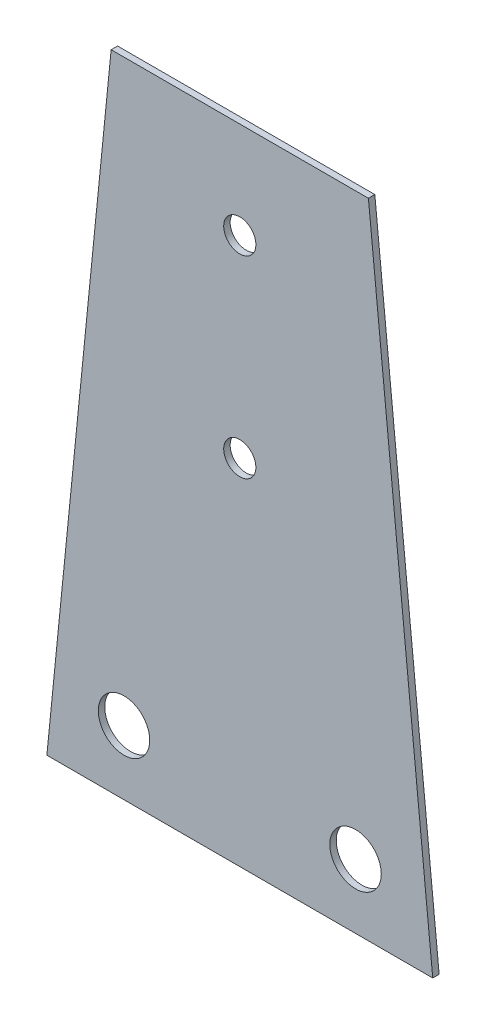
ISO-10303-21;
HEADER;
FILE_DESCRIPTION(('STEP AP214'),'2;1');
FILE_NAME('part.step','',(''),(''),'','','');
FILE_SCHEMA(('AUTOMOTIVE_DESIGN { 1 0 10303 214 1 1 1 1 }'));
ENDSEC;
DATA;
#1=APPLICATION_CONTEXT('core data for automotive mechanical design processes');
#2=APPLICATION_PROTOCOL_DEFINITION('international standard','automotive_design',2000,#1);
#3=PRODUCT_CONTEXT('',#1,'mechanical');
#4=PRODUCT('Part','Part','',(#3));
#5=PRODUCT_RELATED_PRODUCT_CATEGORY('part','',(#4));
#6=PRODUCT_DEFINITION_FORMATION('','',#4);
#7=PRODUCT_DEFINITION_CONTEXT('part definition',#1,'design');
#8=PRODUCT_DEFINITION('design','',#6,#7);
#9=PRODUCT_DEFINITION_SHAPE('','',#8);
#10=(LENGTH_UNIT() NAMED_UNIT(*) SI_UNIT(.MILLI.,.METRE.));
#11=(NAMED_UNIT(*) PLANE_ANGLE_UNIT() SI_UNIT($,.RADIAN.));
#12=(NAMED_UNIT(*) SI_UNIT($,.STERADIAN.) SOLID_ANGLE_UNIT());
#13=UNCERTAINTY_MEASURE_WITH_UNIT(LENGTH_MEASURE(1.E-05),#10,'distance_accuracy_value','');
#14=(GEOMETRIC_REPRESENTATION_CONTEXT(3) GLOBAL_UNCERTAINTY_ASSIGNED_CONTEXT((#13)) GLOBAL_UNIT_ASSIGNED_CONTEXT((#10,
#11,#12)) REPRESENTATION_CONTEXT('',''));
#15=CARTESIAN_POINT('',(0.,0.,0.));
#16=DIRECTION('',(0.,0.,1.));
#17=DIRECTION('',(1.,0.,0.));
#18=AXIS2_PLACEMENT_3D('',#15,#16,#17);
#19=CARTESIAN_POINT('',(-30.,-24.8196817018159,1.));
#20=DIRECTION('',(0.995037190209989,-0.0995037190209989,0.));
#21=DIRECTION('',(0.0995037190209989,0.995037190209989,0.));
#22=AXIS2_PLACEMENT_3D('',#19,#20,#21);
#23=PLANE('',#22);
#24=DIRECTION('',(-0.0995037190209989,-0.995037190209989,0.));
#25=VECTOR('',#24,1.);
#26=CARTESIAN_POINT('',(-30.,-24.8196817018159,0.));
#27=LINE('',#26,#25);
#28=CARTESIAN_POINT('',(-20.,75.1803182981841,0.));
#29=VERTEX_POINT('',#28);
#30=CARTESIAN_POINT('',(-30.,-24.8196817018159,0.));
#31=VERTEX_POINT('',#30);
#32=EDGE_CURVE('E107',#29,#31,#27,.T.);
#33=ORIENTED_EDGE('',*,*,#32,.T.);
#34=DIRECTION('',(0.,0.,-1.));
#35=VECTOR('',#34,1.);
#36=CARTESIAN_POINT('',(-30.,-24.8196817018159,1.));
#37=LINE('',#36,#35);
#38=CARTESIAN_POINT('',(-30.,-24.8196817018159,1.));
#39=VERTEX_POINT('',#38);
#40=EDGE_CURVE('E11',#39,#31,#37,.T.);
#41=ORIENTED_EDGE('',*,*,#40,.F.);
#42=DIRECTION('',(-0.0995037190209989,-0.995037190209989,0.));
#43=VECTOR('',#42,1.);
#44=CARTESIAN_POINT('',(-30.,-24.8196817018159,1.));
#45=LINE('',#44,#43);
#46=CARTESIAN_POINT('',(-20.,75.1803182981841,1.));
#47=VERTEX_POINT('',#46);
#48=EDGE_CURVE('E91',#47,#39,#45,.T.);
#49=ORIENTED_EDGE('',*,*,#48,.F.);
#50=DIRECTION('',(0.,0.,-1.));
#51=VECTOR('',#50,1.);
#52=CARTESIAN_POINT('',(-20.,75.1803182981841,1.));
#53=LINE('',#52,#51);
#54=EDGE_CURVE('E103',#47,#29,#53,.T.);
#55=ORIENTED_EDGE('',*,*,#54,.T.);
#56=EDGE_LOOP('',(#33,#41,#49,#55));
#57=FACE_BOUND('',#56,.T.);
#58=ADVANCED_FACE('F39',(#57),#23,.F.);
#59=CARTESIAN_POINT('',(30.,-24.8196817018159,1.));
#60=DIRECTION('',(0.,1.,0.));
#61=DIRECTION('',(0.,0.,1.));
#62=AXIS2_PLACEMENT_3D('',#59,#60,#61);
#63=PLANE('',#62);
#64=DIRECTION('',(1.,0.,0.));
#65=VECTOR('',#64,1.);
#66=CARTESIAN_POINT('',(30.,-24.8196817018159,0.));
#67=LINE('',#66,#65);
#68=CARTESIAN_POINT('',(30.,-24.8196817018159,0.));
#69=VERTEX_POINT('',#68);
#70=EDGE_CURVE('E96',#31,#69,#67,.T.);
#71=ORIENTED_EDGE('',*,*,#70,.T.);
#72=DIRECTION('',(0.,0.,-1.));
#73=VECTOR('',#72,1.);
#74=CARTESIAN_POINT('',(30.,-24.8196817018159,1.));
#75=LINE('',#74,#73);
#76=CARTESIAN_POINT('',(30.,-24.8196817018159,1.));
#77=VERTEX_POINT('',#76);
#78=EDGE_CURVE('E48',#77,#69,#75,.T.);
#79=ORIENTED_EDGE('',*,*,#78,.F.);
#80=DIRECTION('',(1.,0.,0.));
#81=VECTOR('',#80,1.);
#82=CARTESIAN_POINT('',(30.,-24.8196817018159,1.));
#83=LINE('',#82,#81);
#84=EDGE_CURVE('E86',#39,#77,#83,.T.);
#85=ORIENTED_EDGE('',*,*,#84,.F.);
#86=ORIENTED_EDGE('',*,*,#40,.T.);
#87=EDGE_LOOP('',(#71,#79,#85,#86));
#88=FACE_BOUND('',#87,.T.);
#89=ADVANCED_FACE('F95',(#88),#63,.F.);
#90=CARTESIAN_POINT('',(20.,75.1803182981841,1.));
#91=DIRECTION('',(-0.995037190209989,-0.0995037190209989,0.));
#92=DIRECTION('',(0.0995037190209989,-0.995037190209989,0.));
#93=AXIS2_PLACEMENT_3D('',#90,#91,#92);
#94=PLANE('',#93);
#95=DIRECTION('',(-0.0995037190209989,0.995037190209989,0.));
#96=VECTOR('',#95,1.);
#97=CARTESIAN_POINT('',(20.,75.1803182981841,0.));
#98=LINE('',#97,#96);
#99=CARTESIAN_POINT('',(20.,75.1803182981841,0.));
#100=VERTEX_POINT('',#99);
#101=EDGE_CURVE('E73',#69,#100,#98,.T.);
#102=ORIENTED_EDGE('',*,*,#101,.T.);
#103=DIRECTION('',(0.,0.,-1.));
#104=VECTOR('',#103,1.);
#105=CARTESIAN_POINT('',(20.,75.1803182981841,1.));
#106=LINE('',#105,#104);
#107=CARTESIAN_POINT('',(20.,75.1803182981841,1.));
#108=VERTEX_POINT('',#107);
#109=EDGE_CURVE('E98',#108,#100,#106,.T.);
#110=ORIENTED_EDGE('',*,*,#109,.F.);
#111=DIRECTION('',(-0.0995037190209989,0.995037190209989,0.));
#112=VECTOR('',#111,1.);
#113=CARTESIAN_POINT('',(20.,75.1803182981841,1.));
#114=LINE('',#113,#112);
#115=EDGE_CURVE('E89',#77,#108,#114,.T.);
#116=ORIENTED_EDGE('',*,*,#115,.F.);
#117=ORIENTED_EDGE('',*,*,#78,.T.);
#118=EDGE_LOOP('',(#102,#110,#116,#117));
#119=FACE_BOUND('',#118,.T.);
#120=ADVANCED_FACE('F99',(#119),#94,.F.);
#121=CARTESIAN_POINT('',(-20.,75.1803182981841,1.));
#122=DIRECTION('',(0.,-1.,0.));
#123=DIRECTION('',(0.,0.,-1.));
#124=AXIS2_PLACEMENT_3D('',#121,#122,#123);
#125=PLANE('',#124);
#126=DIRECTION('',(-1.,0.,0.));
#127=VECTOR('',#126,1.);
#128=CARTESIAN_POINT('',(-20.,75.1803182981841,0.));
#129=LINE('',#128,#127);
#130=EDGE_CURVE('E79',#100,#29,#129,.T.);
#131=ORIENTED_EDGE('',*,*,#130,.T.);
#132=ORIENTED_EDGE('',*,*,#54,.F.);
#133=DIRECTION('',(-1.,0.,0.));
#134=VECTOR('',#133,1.);
#135=CARTESIAN_POINT('',(-20.,75.1803182981841,1.));
#136=LINE('',#135,#134);
#137=EDGE_CURVE('E56',#108,#47,#136,.T.);
#138=ORIENTED_EDGE('',*,*,#137,.F.);
#139=ORIENTED_EDGE('',*,*,#109,.T.);
#140=EDGE_LOOP('',(#131,#132,#138,#139));
#141=FACE_BOUND('',#140,.T.);
#142=ADVANCED_FACE('F121',(#141),#125,.F.);
#143=CARTESIAN_POINT('',(0.,0.,1.));
#144=DIRECTION('',(0.,0.,-1.));
#145=DIRECTION('',(-1.,0.,0.));
#146=AXIS2_PLACEMENT_3D('',#143,#144,#145);
#147=PLANE('',#146);
#148=CARTESIAN_POINT('',(18.,-14.8196817018159,1.));
#149=DIRECTION('',(0.,0.,1.));
#150=DIRECTION('',(1.,0.,0.));
#151=AXIS2_PLACEMENT_3D('',#148,#149,#150);
#152=CIRCLE('',#151,4.);
#153=CARTESIAN_POINT('',(22.,-14.8196817018159,1.));
#154=VERTEX_POINT('',#153);
#155=EDGE_CURVE('E145',#154,#154,#152,.T.);
#156=ORIENTED_EDGE('',*,*,#155,.F.);
#157=EDGE_LOOP('',(#156));
#158=FACE_BOUND('',#157,.T.);
#159=CARTESIAN_POINT('',(0.,30.1803182981841,1.));
#160=DIRECTION('',(0.,0.,1.));
#161=DIRECTION('',(1.,0.,0.));
#162=AXIS2_PLACEMENT_3D('',#159,#160,#161);
#163=CIRCLE('',#162,2.5);
#164=CARTESIAN_POINT('',(2.5,30.1803182981841,1.));
#165=VERTEX_POINT('',#164);
#166=EDGE_CURVE('E146',#165,#165,#163,.T.);
#167=ORIENTED_EDGE('',*,*,#166,.F.);
#168=EDGE_LOOP('',(#167));
#169=FACE_BOUND('',#168,.T.);
#170=CARTESIAN_POINT('',(0.,60.1803182981841,1.));
#171=DIRECTION('',(0.,0.,1.));
#172=DIRECTION('',(1.,0.,0.));
#173=AXIS2_PLACEMENT_3D('',#170,#171,#172);
#174=CIRCLE('',#173,2.5);
#175=CARTESIAN_POINT('',(2.5,60.1803182981841,1.));
#176=VERTEX_POINT('',#175);
#177=EDGE_CURVE('E128',#176,#176,#174,.T.);
#178=ORIENTED_EDGE('',*,*,#177,.F.);
#179=EDGE_LOOP('',(#178));
#180=FACE_BOUND('',#179,.T.);
#181=CARTESIAN_POINT('',(-18.,-14.8196817018159,1.));
#182=DIRECTION('',(0.,0.,1.));
#183=DIRECTION('',(1.,0.,0.));
#184=AXIS2_PLACEMENT_3D('',#181,#182,#183);
#185=CIRCLE('',#184,4.);
#186=CARTESIAN_POINT('',(-14.,-14.8196817018159,1.));
#187=VERTEX_POINT('',#186);
#188=EDGE_CURVE('E137',#187,#187,#185,.T.);
#189=ORIENTED_EDGE('',*,*,#188,.F.);
#190=EDGE_LOOP('',(#189));
#191=FACE_BOUND('',#190,.T.);
#192=ORIENTED_EDGE('',*,*,#48,.T.);
#193=ORIENTED_EDGE('',*,*,#84,.T.);
#194=ORIENTED_EDGE('',*,*,#115,.T.);
#195=ORIENTED_EDGE('',*,*,#137,.T.);
#196=EDGE_LOOP('',(#192,#193,#194,#195));
#197=FACE_BOUND('',#196,.T.);
#198=ADVANCED_FACE('F87',(#158,#169,#180,#191,#197),#147,.F.);
#199=CARTESIAN_POINT('',(0.,0.,0.));
#200=DIRECTION('',(0.,0.,-1.));
#201=DIRECTION('',(-1.,0.,0.));
#202=AXIS2_PLACEMENT_3D('',#199,#200,#201);
#203=PLANE('',#202);
#204=CARTESIAN_POINT('',(18.,-14.8196817018159,0.));
#205=DIRECTION('',(0.,0.,1.));
#206=DIRECTION('',(1.,0.,0.));
#207=AXIS2_PLACEMENT_3D('',#204,#205,#206);
#208=CIRCLE('',#207,4.);
#209=CARTESIAN_POINT('',(22.,-14.8196817018159,0.));
#210=VERTEX_POINT('',#209);
#211=EDGE_CURVE('E111',#210,#210,#208,.T.);
#212=ORIENTED_EDGE('',*,*,#211,.T.);
#213=EDGE_LOOP('',(#212));
#214=FACE_BOUND('',#213,.T.);
#215=CARTESIAN_POINT('',(0.,30.1803182981841,0.));
#216=DIRECTION('',(0.,0.,1.));
#217=DIRECTION('',(1.,0.,0.));
#218=AXIS2_PLACEMENT_3D('',#215,#216,#217);
#219=CIRCLE('',#218,2.5);
#220=CARTESIAN_POINT('',(2.5,30.1803182981841,0.));
#221=VERTEX_POINT('',#220);
#222=EDGE_CURVE('E133',#221,#221,#219,.T.);
#223=ORIENTED_EDGE('',*,*,#222,.T.);
#224=EDGE_LOOP('',(#223));
#225=FACE_BOUND('',#224,.T.);
#226=CARTESIAN_POINT('',(0.,60.1803182981841,0.));
#227=DIRECTION('',(0.,0.,1.));
#228=DIRECTION('',(1.,0.,0.));
#229=AXIS2_PLACEMENT_3D('',#226,#227,#228);
#230=CIRCLE('',#229,2.5);
#231=CARTESIAN_POINT('',(2.5,60.1803182981841,0.));
#232=VERTEX_POINT('',#231);
#233=EDGE_CURVE('E132',#232,#232,#230,.T.);
#234=ORIENTED_EDGE('',*,*,#233,.T.);
#235=EDGE_LOOP('',(#234));
#236=FACE_BOUND('',#235,.T.);
#237=CARTESIAN_POINT('',(-18.,-14.8196817018159,0.));
#238=DIRECTION('',(0.,0.,1.));
#239=DIRECTION('',(1.,0.,0.));
#240=AXIS2_PLACEMENT_3D('',#237,#238,#239);
#241=CIRCLE('',#240,4.);
#242=CARTESIAN_POINT('',(-14.,-14.8196817018159,0.));
#243=VERTEX_POINT('',#242);
#244=EDGE_CURVE('E141',#243,#243,#241,.T.);
#245=ORIENTED_EDGE('',*,*,#244,.T.);
#246=EDGE_LOOP('',(#245));
#247=FACE_BOUND('',#246,.T.);
#248=ORIENTED_EDGE('',*,*,#32,.F.);
#249=ORIENTED_EDGE('',*,*,#130,.F.);
#250=ORIENTED_EDGE('',*,*,#101,.F.);
#251=ORIENTED_EDGE('',*,*,#70,.F.);
#252=EDGE_LOOP('',(#248,#249,#250,#251));
#253=FACE_BOUND('',#252,.T.);
#254=ADVANCED_FACE('F124',(#214,#225,#236,#247,#253),#203,.T.);
#255=CARTESIAN_POINT('',(-18.,-14.8196817018159,0.));
#256=DIRECTION('',(0.,0.,1.));
#257=DIRECTION('',(1.,0.,0.));
#258=AXIS2_PLACEMENT_3D('',#255,#256,#257);
#259=CYLINDRICAL_SURFACE('',#258,4.);
#260=ORIENTED_EDGE('',*,*,#244,.F.);
#261=EDGE_LOOP('',(#260));
#262=FACE_BOUND('',#261,.T.);
#263=ORIENTED_EDGE('',*,*,#188,.T.);
#264=EDGE_LOOP('',(#263));
#265=FACE_BOUND('',#264,.T.);
#266=ADVANCED_FACE('F178',(#262,#265),#259,.F.);
#267=CARTESIAN_POINT('',(0.,60.1803182981841,0.));
#268=DIRECTION('',(0.,0.,1.));
#269=DIRECTION('',(1.,0.,0.));
#270=AXIS2_PLACEMENT_3D('',#267,#268,#269);
#271=CYLINDRICAL_SURFACE('',#270,2.5);
#272=ORIENTED_EDGE('',*,*,#233,.F.);
#273=EDGE_LOOP('',(#272));
#274=FACE_BOUND('',#273,.T.);
#275=ORIENTED_EDGE('',*,*,#177,.T.);
#276=EDGE_LOOP('',(#275));
#277=FACE_BOUND('',#276,.T.);
#278=ADVANCED_FACE('F180',(#274,#277),#271,.F.);
#279=CARTESIAN_POINT('',(0.,30.1803182981841,0.));
#280=DIRECTION('',(0.,0.,1.));
#281=DIRECTION('',(1.,0.,0.));
#282=AXIS2_PLACEMENT_3D('',#279,#280,#281);
#283=CYLINDRICAL_SURFACE('',#282,2.5);
#284=ORIENTED_EDGE('',*,*,#222,.F.);
#285=EDGE_LOOP('',(#284));
#286=FACE_BOUND('',#285,.T.);
#287=ORIENTED_EDGE('',*,*,#166,.T.);
#288=EDGE_LOOP('',(#287));
#289=FACE_BOUND('',#288,.T.);
#290=ADVANCED_FACE('F165',(#286,#289),#283,.F.);
#291=CARTESIAN_POINT('',(18.,-14.8196817018159,0.));
#292=DIRECTION('',(0.,0.,1.));
#293=DIRECTION('',(1.,0.,0.));
#294=AXIS2_PLACEMENT_3D('',#291,#292,#293);
#295=CYLINDRICAL_SURFACE('',#294,4.);
#296=ORIENTED_EDGE('',*,*,#211,.F.);
#297=EDGE_LOOP('',(#296));
#298=FACE_BOUND('',#297,.T.);
#299=ORIENTED_EDGE('',*,*,#155,.T.);
#300=EDGE_LOOP('',(#299));
#301=FACE_BOUND('',#300,.T.);
#302=ADVANCED_FACE('F162',(#298,#301),#295,.F.);
#303=CLOSED_SHELL('',(#58,#89,#120,#142,#198,#254,#266,#278,#290,#302));
#304=MANIFOLD_SOLID_BREP('B2',#303);
#305=ADVANCED_BREP_SHAPE_REPRESENTATION('',(#18,#304),#14);
#306=SHAPE_DEFINITION_REPRESENTATION(#9,#305);
ENDSEC;
END-ISO-10303-21;
